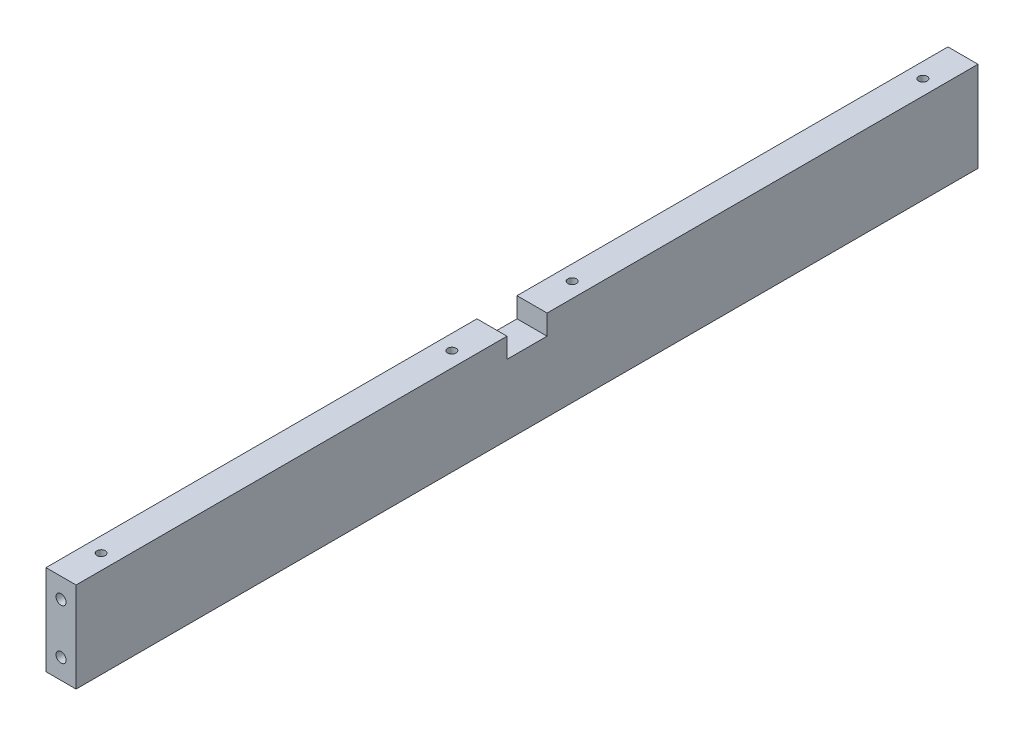
ISO-10303-21;
HEADER;
FILE_DESCRIPTION(('STEP AP214'),'2;1');
FILE_NAME('part.step','',(''),(''),'','','');
FILE_SCHEMA(('AUTOMOTIVE_DESIGN { 1 0 10303 214 1 1 1 1 }'));
ENDSEC;
DATA;
#1=APPLICATION_CONTEXT('core data for automotive mechanical design processes');
#2=APPLICATION_PROTOCOL_DEFINITION('international standard','automotive_design',2000,#1);
#3=PRODUCT_CONTEXT('',#1,'mechanical');
#4=PRODUCT('Part','Part','',(#3));
#5=PRODUCT_RELATED_PRODUCT_CATEGORY('part','',(#4));
#6=PRODUCT_DEFINITION_FORMATION('','',#4);
#7=PRODUCT_DEFINITION_CONTEXT('part definition',#1,'design');
#8=PRODUCT_DEFINITION('design','',#6,#7);
#9=PRODUCT_DEFINITION_SHAPE('','',#8);
#10=(LENGTH_UNIT() NAMED_UNIT(*) SI_UNIT(.MILLI.,.METRE.));
#11=(NAMED_UNIT(*) PLANE_ANGLE_UNIT() SI_UNIT($,.RADIAN.));
#12=(NAMED_UNIT(*) SI_UNIT($,.STERADIAN.) SOLID_ANGLE_UNIT());
#13=UNCERTAINTY_MEASURE_WITH_UNIT(LENGTH_MEASURE(1.E-05),#10,'distance_accuracy_value','');
#14=(GEOMETRIC_REPRESENTATION_CONTEXT(3) GLOBAL_UNCERTAINTY_ASSIGNED_CONTEXT((#13)) GLOBAL_UNIT_ASSIGNED_CONTEXT((#10,
#11,#12)) REPRESENTATION_CONTEXT('',''));
#15=CARTESIAN_POINT('',(0.,0.,0.));
#16=DIRECTION('',(0.,0.,1.));
#17=DIRECTION('',(1.,0.,0.));
#18=AXIS2_PLACEMENT_3D('',#15,#16,#17);
#19=CARTESIAN_POINT('',(0.,45.,450.));
#20=DIRECTION('',(0.,-1.,0.));
#21=DIRECTION('',(0.,0.,-1.));
#22=AXIS2_PLACEMENT_3D('',#19,#20,#21);
#23=PLANE('',#22);
#24=CARTESIAN_POINT('',(-7.5,45.,430.));
#25=DIRECTION('',(0.,1.,0.));
#26=DIRECTION('',(0.,0.,1.));
#27=AXIS2_PLACEMENT_3D('',#24,#25,#26);
#28=CIRCLE('',#27,2.09999999999999);
#29=CARTESIAN_POINT('',(-7.5,45.,432.1));
#30=VERTEX_POINT('',#29);
#31=EDGE_CURVE('E140',#30,#30,#28,.T.);
#32=ORIENTED_EDGE('',*,*,#31,.F.);
#33=EDGE_LOOP('',(#32));
#34=FACE_BOUND('',#33,.T.);
#35=CARTESIAN_POINT('',(-7.5,45.,255.));
#36=DIRECTION('',(0.,1.,0.));
#37=DIRECTION('',(0.,0.,1.));
#38=AXIS2_PLACEMENT_3D('',#35,#36,#37);
#39=CIRCLE('',#38,2.09999999999999);
#40=CARTESIAN_POINT('',(-7.5,45.,257.1));
#41=VERTEX_POINT('',#40);
#42=EDGE_CURVE('E139',#41,#41,#39,.T.);
#43=ORIENTED_EDGE('',*,*,#42,.F.);
#44=EDGE_LOOP('',(#43));
#45=FACE_BOUND('',#44,.T.);
#46=DIRECTION('',(0.,0.,-1.));
#47=VECTOR('',#46,1.);
#48=CARTESIAN_POINT('',(0.,45.,450.));
#49=LINE('',#48,#47);
#50=CARTESIAN_POINT('',(0.,45.,450.));
#51=VERTEX_POINT('',#50);
#52=CARTESIAN_POINT('',(0.,45.,235.));
#53=VERTEX_POINT('',#52);
#54=EDGE_CURVE('E11',#51,#53,#49,.T.);
#55=ORIENTED_EDGE('',*,*,#54,.T.);
#56=DIRECTION('',(1.,0.,0.));
#57=VECTOR('',#56,1.);
#58=CARTESIAN_POINT('',(-15.,45.,235.));
#59=LINE('',#58,#57);
#60=CARTESIAN_POINT('',(-15.,45.,235.));
#61=VERTEX_POINT('',#60);
#62=EDGE_CURVE('E178',#61,#53,#59,.T.);
#63=ORIENTED_EDGE('',*,*,#62,.F.);
#64=DIRECTION('',(0.,0.,-1.));
#65=VECTOR('',#64,1.);
#66=CARTESIAN_POINT('',(-15.,45.,450.));
#67=LINE('',#66,#65);
#68=CARTESIAN_POINT('',(-15.,45.,450.));
#69=VERTEX_POINT('',#68);
#70=EDGE_CURVE('E229',#69,#61,#67,.T.);
#71=ORIENTED_EDGE('',*,*,#70,.F.);
#72=DIRECTION('',(-1.,0.,0.));
#73=VECTOR('',#72,1.);
#74=CARTESIAN_POINT('',(0.,45.,450.));
#75=LINE('',#74,#73);
#76=EDGE_CURVE('E85',#51,#69,#75,.T.);
#77=ORIENTED_EDGE('',*,*,#76,.F.);
#78=EDGE_LOOP('',(#55,#63,#71,#77));
#79=FACE_BOUND('',#78,.T.);
#80=ADVANCED_FACE('F33',(#34,#45,#79),#23,.F.);
#81=CARTESIAN_POINT('',(0.,0.,450.));
#82=DIRECTION('',(-1.,0.,0.));
#83=DIRECTION('',(0.,-1.,0.));
#84=AXIS2_PLACEMENT_3D('',#81,#82,#83);
#85=PLANE('',#84);
#86=DIRECTION('',(0.,0.,-1.));
#87=VECTOR('',#86,1.);
#88=CARTESIAN_POINT('',(0.,35.,235.));
#89=LINE('',#88,#87);
#90=CARTESIAN_POINT('',(0.,35.,235.));
#91=VERTEX_POINT('',#90);
#92=CARTESIAN_POINT('',(0.,35.,215.));
#93=VERTEX_POINT('',#92);
#94=EDGE_CURVE('E174',#91,#93,#89,.T.);
#95=ORIENTED_EDGE('',*,*,#94,.F.);
#96=DIRECTION('',(0.,-1.,0.));
#97=VECTOR('',#96,1.);
#98=CARTESIAN_POINT('',(0.,45.,235.));
#99=LINE('',#98,#97);
#100=EDGE_CURVE('E162',#53,#91,#99,.T.);
#101=ORIENTED_EDGE('',*,*,#100,.F.);
#102=ORIENTED_EDGE('',*,*,#54,.F.);
#103=DIRECTION('',(0.,1.,0.));
#104=VECTOR('',#103,1.);
#105=CARTESIAN_POINT('',(0.,0.,450.));
#106=LINE('',#105,#104);
#107=CARTESIAN_POINT('',(0.,0.,450.));
#108=VERTEX_POINT('',#107);
#109=EDGE_CURVE('E211',#108,#51,#106,.T.);
#110=ORIENTED_EDGE('',*,*,#109,.F.);
#111=DIRECTION('',(0.,0.,-1.));
#112=VECTOR('',#111,1.);
#113=CARTESIAN_POINT('',(0.,0.,450.));
#114=LINE('',#113,#112);
#115=CARTESIAN_POINT('',(0.,0.,0.));
#116=VERTEX_POINT('',#115);
#117=EDGE_CURVE('E217',#108,#116,#114,.T.);
#118=ORIENTED_EDGE('',*,*,#117,.T.);
#119=DIRECTION('',(0.,1.,0.));
#120=VECTOR('',#119,1.);
#121=CARTESIAN_POINT('',(0.,0.,0.));
#122=LINE('',#121,#120);
#123=CARTESIAN_POINT('',(0.,45.,0.));
#124=VERTEX_POINT('',#123);
#125=EDGE_CURVE('E210',#116,#124,#122,.T.);
#126=ORIENTED_EDGE('',*,*,#125,.T.);
#127=CARTESIAN_POINT('',(0.,45.,215.));
#128=VERTEX_POINT('',#127);
#129=EDGE_CURVE('E41',#128,#124,#49,.T.);
#130=ORIENTED_EDGE('',*,*,#129,.F.);
#131=DIRECTION('',(0.,1.,0.));
#132=VECTOR('',#131,1.);
#133=CARTESIAN_POINT('',(0.,45.,215.));
#134=LINE('',#133,#132);
#135=EDGE_CURVE('E167',#93,#128,#134,.T.);
#136=ORIENTED_EDGE('',*,*,#135,.F.);
#137=EDGE_LOOP('',(#95,#101,#102,#110,#118,#126,#130,#136));
#138=FACE_BOUND('',#137,.T.);
#139=ADVANCED_FACE('F35',(#138),#85,.F.);
#140=CARTESIAN_POINT('',(-7.5,45.,195.));
#141=DIRECTION('',(0.,1.,0.));
#142=DIRECTION('',(0.,0.,1.));
#143=AXIS2_PLACEMENT_3D('',#140,#141,#142);
#144=CIRCLE('',#143,2.09999999999999);
#145=CARTESIAN_POINT('',(-7.5,45.,197.1));
#146=VERTEX_POINT('',#145);
#147=EDGE_CURVE('E150',#146,#146,#144,.T.);
#148=ORIENTED_EDGE('',*,*,#147,.F.);
#149=EDGE_LOOP('',(#148));
#150=FACE_BOUND('',#149,.T.);
#151=CARTESIAN_POINT('',(-7.5,45.,20.));
#152=DIRECTION('',(0.,1.,0.));
#153=DIRECTION('',(0.,0.,1.));
#154=AXIS2_PLACEMENT_3D('',#151,#152,#153);
#155=CIRCLE('',#154,2.09999999999999);
#156=CARTESIAN_POINT('',(-7.5,45.,22.1));
#157=VERTEX_POINT('',#156);
#158=EDGE_CURVE('E156',#157,#157,#155,.T.);
#159=ORIENTED_EDGE('',*,*,#158,.F.);
#160=EDGE_LOOP('',(#159));
#161=FACE_BOUND('',#160,.T.);
#162=CARTESIAN_POINT('',(-15.,45.,215.));
#163=VERTEX_POINT('',#162);
#164=CARTESIAN_POINT('',(-15.,45.,0.));
#165=VERTEX_POINT('',#164);
#166=EDGE_CURVE('E228',#163,#165,#67,.T.);
#167=ORIENTED_EDGE('',*,*,#166,.F.);
#168=DIRECTION('',(1.,0.,0.));
#169=VECTOR('',#168,1.);
#170=CARTESIAN_POINT('',(-15.,45.,215.));
#171=LINE('',#170,#169);
#172=EDGE_CURVE('E181',#163,#128,#171,.T.);
#173=ORIENTED_EDGE('',*,*,#172,.T.);
#174=ORIENTED_EDGE('',*,*,#129,.T.);
#175=DIRECTION('',(-1.,0.,0.));
#176=VECTOR('',#175,1.);
#177=CARTESIAN_POINT('',(0.,45.,0.));
#178=LINE('',#177,#176);
#179=EDGE_CURVE('E220',#124,#165,#178,.T.);
#180=ORIENTED_EDGE('',*,*,#179,.T.);
#181=EDGE_LOOP('',(#167,#173,#174,#180));
#182=FACE_BOUND('',#181,.T.);
#183=ADVANCED_FACE('F239',(#150,#161,#182),#23,.F.);
#184=CARTESIAN_POINT('',(-15.,0.,450.));
#185=DIRECTION('',(1.,0.,0.));
#186=DIRECTION('',(0.,0.,-1.));
#187=AXIS2_PLACEMENT_3D('',#184,#185,#186);
#188=PLANE('',#187);
#189=ORIENTED_EDGE('',*,*,#70,.T.);
#190=DIRECTION('',(0.,-1.,0.));
#191=VECTOR('',#190,1.);
#192=CARTESIAN_POINT('',(-15.,45.,235.));
#193=LINE('',#192,#191);
#194=CARTESIAN_POINT('',(-15.,35.,235.));
#195=VERTEX_POINT('',#194);
#196=EDGE_CURVE('E163',#61,#195,#193,.T.);
#197=ORIENTED_EDGE('',*,*,#196,.T.);
#198=DIRECTION('',(0.,0.,-1.));
#199=VECTOR('',#198,1.);
#200=CARTESIAN_POINT('',(-15.,35.,235.));
#201=LINE('',#200,#199);
#202=CARTESIAN_POINT('',(-15.,35.,215.));
#203=VERTEX_POINT('',#202);
#204=EDGE_CURVE('E166',#195,#203,#201,.T.);
#205=ORIENTED_EDGE('',*,*,#204,.T.);
#206=DIRECTION('',(0.,1.,0.));
#207=VECTOR('',#206,1.);
#208=CARTESIAN_POINT('',(-15.,45.,215.));
#209=LINE('',#208,#207);
#210=EDGE_CURVE('E48',#203,#163,#209,.T.);
#211=ORIENTED_EDGE('',*,*,#210,.T.);
#212=ORIENTED_EDGE('',*,*,#166,.T.);
#213=DIRECTION('',(0.,-1.,0.));
#214=VECTOR('',#213,1.);
#215=CARTESIAN_POINT('',(-15.,0.,0.));
#216=LINE('',#215,#214);
#217=CARTESIAN_POINT('',(-15.,0.,0.));
#218=VERTEX_POINT('',#217);
#219=EDGE_CURVE('E223',#165,#218,#216,.T.);
#220=ORIENTED_EDGE('',*,*,#219,.T.);
#221=DIRECTION('',(0.,0.,-1.));
#222=VECTOR('',#221,1.);
#223=CARTESIAN_POINT('',(-15.,0.,450.));
#224=LINE('',#223,#222);
#225=CARTESIAN_POINT('',(-15.,0.,450.));
#226=VERTEX_POINT('',#225);
#227=EDGE_CURVE('E227',#226,#218,#224,.T.);
#228=ORIENTED_EDGE('',*,*,#227,.F.);
#229=DIRECTION('',(0.,-1.,0.));
#230=VECTOR('',#229,1.);
#231=CARTESIAN_POINT('',(-15.,0.,450.));
#232=LINE('',#231,#230);
#233=EDGE_CURVE('E214',#69,#226,#232,.T.);
#234=ORIENTED_EDGE('',*,*,#233,.F.);
#235=EDGE_LOOP('',(#189,#197,#205,#211,#212,#220,#228,#234));
#236=FACE_BOUND('',#235,.T.);
#237=ADVANCED_FACE('F234',(#236),#188,.F.);
#238=CARTESIAN_POINT('',(0.,0.,450.));
#239=DIRECTION('',(0.,1.,0.));
#240=DIRECTION('',(0.,0.,1.));
#241=AXIS2_PLACEMENT_3D('',#238,#239,#240);
#242=PLANE('',#241);
#243=DIRECTION('',(1.,0.,0.));
#244=VECTOR('',#243,1.);
#245=CARTESIAN_POINT('',(0.,0.,0.));
#246=LINE('',#245,#244);
#247=EDGE_CURVE('E78',#218,#116,#246,.T.);
#248=ORIENTED_EDGE('',*,*,#247,.T.);
#249=ORIENTED_EDGE('',*,*,#117,.F.);
#250=DIRECTION('',(1.,0.,0.));
#251=VECTOR('',#250,1.);
#252=CARTESIAN_POINT('',(0.,0.,450.));
#253=LINE('',#252,#251);
#254=EDGE_CURVE('E57',#226,#108,#253,.T.);
#255=ORIENTED_EDGE('',*,*,#254,.F.);
#256=ORIENTED_EDGE('',*,*,#227,.T.);
#257=EDGE_LOOP('',(#248,#249,#255,#256));
#258=FACE_BOUND('',#257,.T.);
#259=ADVANCED_FACE('F249',(#258),#242,.F.);
#260=CARTESIAN_POINT('',(0.,0.,450.));
#261=DIRECTION('',(0.,0.,1.));
#262=DIRECTION('',(1.,0.,0.));
#263=AXIS2_PLACEMENT_3D('',#260,#261,#262);
#264=PLANE('',#263);
#265=CARTESIAN_POINT('',(-7.5,35.,450.));
#266=DIRECTION('',(0.,0.,1.));
#267=DIRECTION('',(1.,0.,0.));
#268=AXIS2_PLACEMENT_3D('',#265,#266,#267);
#269=CIRCLE('',#268,2.49999999999999);
#270=CARTESIAN_POINT('',(-5.00000000000001,35.,450.));
#271=VERTEX_POINT('',#270);
#272=EDGE_CURVE('E198',#271,#271,#269,.T.);
#273=ORIENTED_EDGE('',*,*,#272,.F.);
#274=EDGE_LOOP('',(#273));
#275=FACE_BOUND('',#274,.T.);
#276=CARTESIAN_POINT('',(-7.5,10.,450.));
#277=DIRECTION('',(0.,0.,1.));
#278=DIRECTION('',(1.,0.,0.));
#279=AXIS2_PLACEMENT_3D('',#276,#277,#278);
#280=CIRCLE('',#279,2.49999999999999);
#281=CARTESIAN_POINT('',(-5.00000000000001,10.,450.));
#282=VERTEX_POINT('',#281);
#283=EDGE_CURVE('E204',#282,#282,#280,.T.);
#284=ORIENTED_EDGE('',*,*,#283,.F.);
#285=EDGE_LOOP('',(#284));
#286=FACE_BOUND('',#285,.T.);
#287=ORIENTED_EDGE('',*,*,#109,.T.);
#288=ORIENTED_EDGE('',*,*,#76,.T.);
#289=ORIENTED_EDGE('',*,*,#233,.T.);
#290=ORIENTED_EDGE('',*,*,#254,.T.);
#291=EDGE_LOOP('',(#287,#288,#289,#290));
#292=FACE_BOUND('',#291,.T.);
#293=ADVANCED_FACE('F250',(#275,#286,#292),#264,.T.);
#294=CARTESIAN_POINT('',(0.,0.,0.));
#295=DIRECTION('',(0.,0.,1.));
#296=DIRECTION('',(1.,0.,0.));
#297=AXIS2_PLACEMENT_3D('',#294,#295,#296);
#298=PLANE('',#297);
#299=CARTESIAN_POINT('',(-7.5,35.,0.));
#300=DIRECTION('',(0.,0.,-1.));
#301=DIRECTION('',(-1.,0.,0.));
#302=AXIS2_PLACEMENT_3D('',#299,#300,#301);
#303=CIRCLE('',#302,2.49999999999999);
#304=CARTESIAN_POINT('',(-9.99999999999999,35.,0.));
#305=VERTEX_POINT('',#304);
#306=EDGE_CURVE('E180',#305,#305,#303,.T.);
#307=ORIENTED_EDGE('',*,*,#306,.F.);
#308=EDGE_LOOP('',(#307));
#309=FACE_BOUND('',#308,.T.);
#310=CARTESIAN_POINT('',(-7.5,10.,0.));
#311=DIRECTION('',(0.,0.,-1.));
#312=DIRECTION('',(-1.,0.,0.));
#313=AXIS2_PLACEMENT_3D('',#310,#311,#312);
#314=CIRCLE('',#313,2.49999999999999);
#315=CARTESIAN_POINT('',(-9.99999999999999,10.,0.));
#316=VERTEX_POINT('',#315);
#317=EDGE_CURVE('E192',#316,#316,#314,.T.);
#318=ORIENTED_EDGE('',*,*,#317,.F.);
#319=EDGE_LOOP('',(#318));
#320=FACE_BOUND('',#319,.T.);
#321=ORIENTED_EDGE('',*,*,#125,.F.);
#322=ORIENTED_EDGE('',*,*,#247,.F.);
#323=ORIENTED_EDGE('',*,*,#219,.F.);
#324=ORIENTED_EDGE('',*,*,#179,.F.);
#325=EDGE_LOOP('',(#321,#322,#323,#324));
#326=FACE_BOUND('',#325,.T.);
#327=ADVANCED_FACE('F243',(#309,#320,#326),#298,.F.);
#328=CARTESIAN_POINT('',(-7.5,10.,440.));
#329=DIRECTION('',(0.,0.,1.));
#330=DIRECTION('',(1.,0.,0.));
#331=AXIS2_PLACEMENT_3D('',#328,#329,#330);
#332=CONICAL_SURFACE('',#331,2.5,1.02974425867666);
#333=CARTESIAN_POINT('',(-7.5,10.,438.497848452431));
#334=VERTEX_POINT('',#333);
#335=VERTEX_LOOP('',#334);
#336=FACE_BOUND('',#335,.T.);
#337=CARTESIAN_POINT('',(-7.5,10.,440.));
#338=DIRECTION('',(0.,0.,1.));
#339=DIRECTION('',(1.,0.,0.));
#340=AXIS2_PLACEMENT_3D('',#337,#338,#339);
#341=CIRCLE('',#340,2.5);
#342=CARTESIAN_POINT('',(-5.,10.,440.));
#343=VERTEX_POINT('',#342);
#344=EDGE_CURVE('E207',#343,#343,#341,.T.);
#345=ORIENTED_EDGE('',*,*,#344,.T.);
#346=EDGE_LOOP('',(#345));
#347=FACE_BOUND('',#346,.T.);
#348=ADVANCED_FACE('F429',(#336,#347),#332,.F.);
#349=CARTESIAN_POINT('',(-7.5,10.,450.));
#350=DIRECTION('',(0.,0.,1.));
#351=DIRECTION('',(1.,0.,0.));
#352=AXIS2_PLACEMENT_3D('',#349,#350,#351);
#353=CYLINDRICAL_SURFACE('',#352,2.49999999999999);
#354=ORIENTED_EDGE('',*,*,#344,.F.);
#355=EDGE_LOOP('',(#354));
#356=FACE_BOUND('',#355,.T.);
#357=ORIENTED_EDGE('',*,*,#283,.T.);
#358=EDGE_LOOP('',(#357));
#359=FACE_BOUND('',#358,.T.);
#360=ADVANCED_FACE('F451',(#356,#359),#353,.F.);
#361=CARTESIAN_POINT('',(-7.5,35.,440.));
#362=DIRECTION('',(0.,0.,1.));
#363=DIRECTION('',(1.,0.,0.));
#364=AXIS2_PLACEMENT_3D('',#361,#362,#363);
#365=CONICAL_SURFACE('',#364,2.5,1.02974425867666);
#366=CARTESIAN_POINT('',(-7.5,35.,438.497848452431));
#367=VERTEX_POINT('',#366);
#368=VERTEX_LOOP('',#367);
#369=FACE_BOUND('',#368,.T.);
#370=CARTESIAN_POINT('',(-7.5,35.,440.));
#371=DIRECTION('',(0.,0.,1.));
#372=DIRECTION('',(1.,0.,0.));
#373=AXIS2_PLACEMENT_3D('',#370,#371,#372);
#374=CIRCLE('',#373,2.5);
#375=CARTESIAN_POINT('',(-5.,35.,440.));
#376=VERTEX_POINT('',#375);
#377=EDGE_CURVE('E201',#376,#376,#374,.T.);
#378=ORIENTED_EDGE('',*,*,#377,.T.);
#379=EDGE_LOOP('',(#378));
#380=FACE_BOUND('',#379,.T.);
#381=ADVANCED_FACE('F441',(#369,#380),#365,.F.);
#382=CARTESIAN_POINT('',(-7.5,35.,450.));
#383=DIRECTION('',(0.,0.,1.));
#384=DIRECTION('',(1.,0.,0.));
#385=AXIS2_PLACEMENT_3D('',#382,#383,#384);
#386=CYLINDRICAL_SURFACE('',#385,2.49999999999999);
#387=ORIENTED_EDGE('',*,*,#377,.F.);
#388=EDGE_LOOP('',(#387));
#389=FACE_BOUND('',#388,.T.);
#390=ORIENTED_EDGE('',*,*,#272,.T.);
#391=EDGE_LOOP('',(#390));
#392=FACE_BOUND('',#391,.T.);
#393=ADVANCED_FACE('F417',(#389,#392),#386,.F.);
#394=CARTESIAN_POINT('',(-7.5,10.,9.99999999999999));
#395=DIRECTION('',(0.,0.,-1.));
#396=DIRECTION('',(-1.,0.,0.));
#397=AXIS2_PLACEMENT_3D('',#394,#395,#396);
#398=CONICAL_SURFACE('',#397,2.49999999999999,1.02974425867665);
#399=CARTESIAN_POINT('',(-7.5,10.,11.5021515475689));
#400=VERTEX_POINT('',#399);
#401=VERTEX_LOOP('',#400);
#402=FACE_BOUND('',#401,.T.);
#403=CARTESIAN_POINT('',(-7.5,10.,9.99999999999999));
#404=DIRECTION('',(0.,0.,-1.));
#405=DIRECTION('',(-1.,0.,0.));
#406=AXIS2_PLACEMENT_3D('',#403,#404,#405);
#407=CIRCLE('',#406,2.49999999999999);
#408=CARTESIAN_POINT('',(-9.99999999999999,10.,9.99999999999999));
#409=VERTEX_POINT('',#408);
#410=EDGE_CURVE('E195',#409,#409,#407,.T.);
#411=ORIENTED_EDGE('',*,*,#410,.T.);
#412=EDGE_LOOP('',(#411));
#413=FACE_BOUND('',#412,.T.);
#414=ADVANCED_FACE('F407',(#402,#413),#398,.F.);
#415=CARTESIAN_POINT('',(-7.5,10.,0.));
#416=DIRECTION('',(0.,0.,-1.));
#417=DIRECTION('',(-1.,0.,0.));
#418=AXIS2_PLACEMENT_3D('',#415,#416,#417);
#419=CYLINDRICAL_SURFACE('',#418,2.49999999999999);
#420=ORIENTED_EDGE('',*,*,#410,.F.);
#421=EDGE_LOOP('',(#420));
#422=FACE_BOUND('',#421,.T.);
#423=ORIENTED_EDGE('',*,*,#317,.T.);
#424=EDGE_LOOP('',(#423));
#425=FACE_BOUND('',#424,.T.);
#426=ADVANCED_FACE('F397',(#422,#425),#419,.F.);
#427=CARTESIAN_POINT('',(-7.5,35.,9.99999999999999));
#428=DIRECTION('',(0.,0.,-1.));
#429=DIRECTION('',(-1.,0.,0.));
#430=AXIS2_PLACEMENT_3D('',#427,#428,#429);
#431=CONICAL_SURFACE('',#430,2.49999999999999,1.02974425867665);
#432=CARTESIAN_POINT('',(-7.5,35.,11.5021515475689));
#433=VERTEX_POINT('',#432);
#434=VERTEX_LOOP('',#433);
#435=FACE_BOUND('',#434,.T.);
#436=CARTESIAN_POINT('',(-7.5,35.,9.99999999999999));
#437=DIRECTION('',(0.,0.,-1.));
#438=DIRECTION('',(-1.,0.,0.));
#439=AXIS2_PLACEMENT_3D('',#436,#437,#438);
#440=CIRCLE('',#439,2.49999999999999);
#441=CARTESIAN_POINT('',(-9.99999999999999,35.,9.99999999999999));
#442=VERTEX_POINT('',#441);
#443=EDGE_CURVE('E189',#442,#442,#440,.T.);
#444=ORIENTED_EDGE('',*,*,#443,.T.);
#445=EDGE_LOOP('',(#444));
#446=FACE_BOUND('',#445,.T.);
#447=ADVANCED_FACE('F387',(#435,#446),#431,.F.);
#448=CARTESIAN_POINT('',(-7.5,35.,0.));
#449=DIRECTION('',(0.,0.,-1.));
#450=DIRECTION('',(-1.,0.,0.));
#451=AXIS2_PLACEMENT_3D('',#448,#449,#450);
#452=CYLINDRICAL_SURFACE('',#451,2.49999999999999);
#453=ORIENTED_EDGE('',*,*,#443,.F.);
#454=EDGE_LOOP('',(#453));
#455=FACE_BOUND('',#454,.T.);
#456=ORIENTED_EDGE('',*,*,#306,.T.);
#457=EDGE_LOOP('',(#456));
#458=FACE_BOUND('',#457,.T.);
#459=ADVANCED_FACE('F267',(#455,#458),#452,.F.);
#460=CARTESIAN_POINT('',(-15.,45.,235.));
#461=DIRECTION('',(0.,0.,1.));
#462=DIRECTION('',(1.,0.,0.));
#463=AXIS2_PLACEMENT_3D('',#460,#461,#462);
#464=PLANE('',#463);
#465=ORIENTED_EDGE('',*,*,#100,.T.);
#466=DIRECTION('',(1.,0.,0.));
#467=VECTOR('',#466,1.);
#468=CARTESIAN_POINT('',(-15.,35.,235.));
#469=LINE('',#468,#467);
#470=EDGE_CURVE('E171',#195,#91,#469,.T.);
#471=ORIENTED_EDGE('',*,*,#470,.F.);
#472=ORIENTED_EDGE('',*,*,#196,.F.);
#473=ORIENTED_EDGE('',*,*,#62,.T.);
#474=EDGE_LOOP('',(#465,#471,#472,#473));
#475=FACE_BOUND('',#474,.T.);
#476=ADVANCED_FACE('F254',(#475),#464,.F.);
#477=CARTESIAN_POINT('',(-15.,45.,215.));
#478=DIRECTION('',(0.,0.,-1.));
#479=DIRECTION('',(-1.,0.,0.));
#480=AXIS2_PLACEMENT_3D('',#477,#478,#479);
#481=PLANE('',#480);
#482=ORIENTED_EDGE('',*,*,#135,.T.);
#483=ORIENTED_EDGE('',*,*,#172,.F.);
#484=ORIENTED_EDGE('',*,*,#210,.F.);
#485=DIRECTION('',(1.,0.,0.));
#486=VECTOR('',#485,1.);
#487=CARTESIAN_POINT('',(-15.,35.,215.));
#488=LINE('',#487,#486);
#489=EDGE_CURVE('E184',#203,#93,#488,.T.);
#490=ORIENTED_EDGE('',*,*,#489,.T.);
#491=EDGE_LOOP('',(#482,#483,#484,#490));
#492=FACE_BOUND('',#491,.T.);
#493=ADVANCED_FACE('F258',(#492),#481,.F.);
#494=CARTESIAN_POINT('',(-15.,35.,235.));
#495=DIRECTION('',(0.,-1.,0.));
#496=DIRECTION('',(1.,0.,0.));
#497=AXIS2_PLACEMENT_3D('',#494,#495,#496);
#498=PLANE('',#497);
#499=ORIENTED_EDGE('',*,*,#94,.T.);
#500=ORIENTED_EDGE('',*,*,#489,.F.);
#501=ORIENTED_EDGE('',*,*,#204,.F.);
#502=ORIENTED_EDGE('',*,*,#470,.T.);
#503=EDGE_LOOP('',(#499,#500,#501,#502));
#504=FACE_BOUND('',#503,.T.);
#505=ADVANCED_FACE('F256',(#504),#498,.F.);
#506=CARTESIAN_POINT('',(-7.5,20.,20.));
#507=DIRECTION('',(0.,1.,0.));
#508=DIRECTION('',(0.,0.,1.));
#509=AXIS2_PLACEMENT_3D('',#506,#507,#508);
#510=CONICAL_SURFACE('',#509,2.09999999999999,1.02974425867665);
#511=CARTESIAN_POINT('',(-7.50000000000001,18.7381927000421,20.));
#512=VERTEX_POINT('',#511);
#513=VERTEX_LOOP('',#512);
#514=FACE_BOUND('',#513,.T.);
#515=CARTESIAN_POINT('',(-7.5,20.,20.));
#516=DIRECTION('',(0.,1.,0.));
#517=DIRECTION('',(0.,0.,1.));
#518=AXIS2_PLACEMENT_3D('',#515,#516,#517);
#519=CIRCLE('',#518,2.09999999999999);
#520=CARTESIAN_POINT('',(-7.5,20.,22.1));
#521=VERTEX_POINT('',#520);
#522=EDGE_CURVE('E159',#521,#521,#519,.T.);
#523=ORIENTED_EDGE('',*,*,#522,.T.);
#524=EDGE_LOOP('',(#523));
#525=FACE_BOUND('',#524,.T.);
#526=ADVANCED_FACE('F265',(#514,#525),#510,.F.);
#527=CARTESIAN_POINT('',(-7.5,45.,20.));
#528=DIRECTION('',(0.,1.,0.));
#529=DIRECTION('',(0.,0.,1.));
#530=AXIS2_PLACEMENT_3D('',#527,#528,#529);
#531=CYLINDRICAL_SURFACE('',#530,2.09999999999999);
#532=ORIENTED_EDGE('',*,*,#522,.F.);
#533=EDGE_LOOP('',(#532));
#534=FACE_BOUND('',#533,.T.);
#535=ORIENTED_EDGE('',*,*,#158,.T.);
#536=EDGE_LOOP('',(#535));
#537=FACE_BOUND('',#536,.T.);
#538=ADVANCED_FACE('F289',(#534,#537),#531,.F.);
#539=CARTESIAN_POINT('',(-7.5,20.,195.));
#540=DIRECTION('',(0.,1.,0.));
#541=DIRECTION('',(0.,0.,1.));
#542=AXIS2_PLACEMENT_3D('',#539,#540,#541);
#543=CONICAL_SURFACE('',#542,2.09999999999999,1.02974425867665);
#544=CARTESIAN_POINT('',(-7.50000000000001,18.7381927000421,195.));
#545=VERTEX_POINT('',#544);
#546=VERTEX_LOOP('',#545);
#547=FACE_BOUND('',#546,.T.);
#548=CARTESIAN_POINT('',(-7.5,20.,195.));
#549=DIRECTION('',(0.,1.,0.));
#550=DIRECTION('',(0.,0.,1.));
#551=AXIS2_PLACEMENT_3D('',#548,#549,#550);
#552=CIRCLE('',#551,2.09999999999999);
#553=CARTESIAN_POINT('',(-7.5,20.,197.1));
#554=VERTEX_POINT('',#553);
#555=EDGE_CURVE('E153',#554,#554,#552,.T.);
#556=ORIENTED_EDGE('',*,*,#555,.T.);
#557=EDGE_LOOP('',(#556));
#558=FACE_BOUND('',#557,.T.);
#559=ADVANCED_FACE('F291',(#547,#558),#543,.F.);
#560=CARTESIAN_POINT('',(-7.5,45.,195.));
#561=DIRECTION('',(0.,1.,0.));
#562=DIRECTION('',(0.,0.,1.));
#563=AXIS2_PLACEMENT_3D('',#560,#561,#562);
#564=CYLINDRICAL_SURFACE('',#563,2.09999999999999);
#565=ORIENTED_EDGE('',*,*,#555,.F.);
#566=EDGE_LOOP('',(#565));
#567=FACE_BOUND('',#566,.T.);
#568=ORIENTED_EDGE('',*,*,#147,.T.);
#569=EDGE_LOOP('',(#568));
#570=FACE_BOUND('',#569,.T.);
#571=ADVANCED_FACE('F298',(#567,#570),#564,.F.);
#572=CARTESIAN_POINT('',(-7.5,20.,255.));
#573=DIRECTION('',(0.,1.,0.));
#574=DIRECTION('',(0.,0.,1.));
#575=AXIS2_PLACEMENT_3D('',#572,#573,#574);
#576=CONICAL_SURFACE('',#575,2.09999999999999,1.02974425867665);
#577=CARTESIAN_POINT('',(-7.50000000000001,18.7381927000421,255.));
#578=VERTEX_POINT('',#577);
#579=VERTEX_LOOP('',#578);
#580=FACE_BOUND('',#579,.T.);
#581=CARTESIAN_POINT('',(-7.5,20.,255.));
#582=DIRECTION('',(0.,1.,0.));
#583=DIRECTION('',(0.,0.,1.));
#584=AXIS2_PLACEMENT_3D('',#581,#582,#583);
#585=CIRCLE('',#584,2.09999999999999);
#586=CARTESIAN_POINT('',(-7.5,20.,257.1));
#587=VERTEX_POINT('',#586);
#588=EDGE_CURVE('E143',#587,#587,#585,.T.);
#589=ORIENTED_EDGE('',*,*,#588,.T.);
#590=EDGE_LOOP('',(#589));
#591=FACE_BOUND('',#590,.T.);
#592=ADVANCED_FACE('F306',(#580,#591),#576,.F.);
#593=CARTESIAN_POINT('',(-7.5,45.,255.));
#594=DIRECTION('',(0.,1.,0.));
#595=DIRECTION('',(0.,0.,1.));
#596=AXIS2_PLACEMENT_3D('',#593,#594,#595);
#597=CYLINDRICAL_SURFACE('',#596,2.09999999999999);
#598=ORIENTED_EDGE('',*,*,#588,.F.);
#599=EDGE_LOOP('',(#598));
#600=FACE_BOUND('',#599,.T.);
#601=ORIENTED_EDGE('',*,*,#42,.T.);
#602=EDGE_LOOP('',(#601));
#603=FACE_BOUND('',#602,.T.);
#604=ADVANCED_FACE('F133',(#600,#603),#597,.F.);
#605=CARTESIAN_POINT('',(-7.5,20.,430.));
#606=DIRECTION('',(0.,1.,0.));
#607=DIRECTION('',(0.,0.,1.));
#608=AXIS2_PLACEMENT_3D('',#605,#606,#607);
#609=CONICAL_SURFACE('',#608,2.09999999999999,1.02974425867665);
#610=CARTESIAN_POINT('',(-7.50000000000001,18.7381927000421,430.));
#611=VERTEX_POINT('',#610);
#612=VERTEX_LOOP('',#611);
#613=FACE_BOUND('',#612,.T.);
#614=CARTESIAN_POINT('',(-7.5,20.,430.));
#615=DIRECTION('',(0.,1.,0.));
#616=DIRECTION('',(0.,0.,1.));
#617=AXIS2_PLACEMENT_3D('',#614,#615,#616);
#618=CIRCLE('',#617,2.09999999999999);
#619=CARTESIAN_POINT('',(-7.5,20.,432.1));
#620=VERTEX_POINT('',#619);
#621=EDGE_CURVE('E137',#620,#620,#618,.T.);
#622=ORIENTED_EDGE('',*,*,#621,.T.);
#623=EDGE_LOOP('',(#622));
#624=FACE_BOUND('',#623,.T.);
#625=ADVANCED_FACE('F129',(#613,#624),#609,.F.);
#626=CARTESIAN_POINT('',(-7.5,45.,430.));
#627=DIRECTION('',(0.,1.,0.));
#628=DIRECTION('',(0.,0.,1.));
#629=AXIS2_PLACEMENT_3D('',#626,#627,#628);
#630=CYLINDRICAL_SURFACE('',#629,2.09999999999999);
#631=ORIENTED_EDGE('',*,*,#621,.F.);
#632=EDGE_LOOP('',(#631));
#633=FACE_BOUND('',#632,.T.);
#634=ORIENTED_EDGE('',*,*,#31,.T.);
#635=EDGE_LOOP('',(#634));
#636=FACE_BOUND('',#635,.T.);
#637=ADVANCED_FACE('F132',(#633,#636),#630,.F.);
#638=CLOSED_SHELL('',(#80,#139,#183,#237,#259,#293,#327,#348,#360,#381,#393,#414,#426,#447,#459,
#476,#493,#505,#526,#538,#559,#571,#592,#604,#625,#637));
#639=MANIFOLD_SOLID_BREP('B2',#638);
#640=ADVANCED_BREP_SHAPE_REPRESENTATION('',(#18,#639),#14);
#641=SHAPE_DEFINITION_REPRESENTATION(#9,#640);
ENDSEC;
END-ISO-10303-21;
